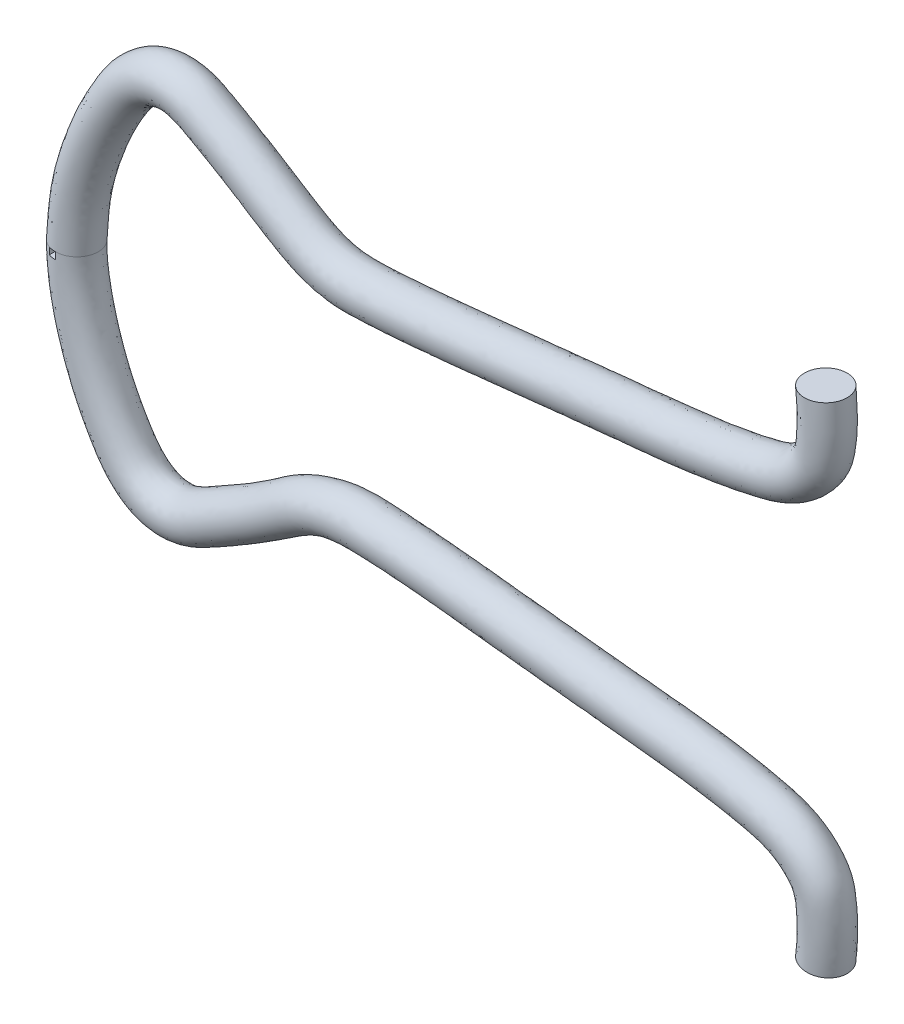
ISO-10303-21;
HEADER;
FILE_DESCRIPTION(('STEP AP214'),'2;1');
FILE_NAME('part.step','',(''),(''),'','','');
FILE_SCHEMA(('AUTOMOTIVE_DESIGN { 1 0 10303 214 1 1 1 1 }'));
ENDSEC;
DATA;
#1=APPLICATION_CONTEXT('core data for automotive mechanical design processes');
#2=APPLICATION_PROTOCOL_DEFINITION('international standard','automotive_design',2000,#1);
#3=PRODUCT_CONTEXT('',#1,'mechanical');
#4=PRODUCT('Part','Part','',(#3));
#5=PRODUCT_RELATED_PRODUCT_CATEGORY('part','',(#4));
#6=PRODUCT_DEFINITION_FORMATION('','',#4);
#7=PRODUCT_DEFINITION_CONTEXT('part definition',#1,'design');
#8=PRODUCT_DEFINITION('design','',#6,#7);
#9=PRODUCT_DEFINITION_SHAPE('','',#8);
#10=(LENGTH_UNIT() NAMED_UNIT(*) SI_UNIT(.MILLI.,.METRE.));
#11=(NAMED_UNIT(*) PLANE_ANGLE_UNIT() SI_UNIT($,.RADIAN.));
#12=(NAMED_UNIT(*) SI_UNIT($,.STERADIAN.) SOLID_ANGLE_UNIT());
#13=UNCERTAINTY_MEASURE_WITH_UNIT(LENGTH_MEASURE(1.E-05),#10,'distance_accuracy_value','');
#14=(GEOMETRIC_REPRESENTATION_CONTEXT(3) GLOBAL_UNCERTAINTY_ASSIGNED_CONTEXT((#13)) GLOBAL_UNIT_ASSIGNED_CONTEXT((#10,
#11,#12)) REPRESENTATION_CONTEXT('',''));
#15=CARTESIAN_POINT('',(0.,0.,0.));
#16=DIRECTION('',(0.,0.,1.));
#17=DIRECTION('',(1.,0.,0.));
#18=AXIS2_PLACEMENT_3D('',#15,#16,#17);
#19=CARTESIAN_POINT('',(-31.85024051314,-0.739097488164255,0.500000000000001));
#20=CARTESIAN_POINT('',(-31.8552836514389,-1.08239667611665,0.500000000000001));
#21=CARTESIAN_POINT('',(-31.762998352297,-1.82891605051562,0.500000000000001));
#22=CARTESIAN_POINT('',(-31.4962403182843,-2.75116930594545,0.500000000000001));
#23=CARTESIAN_POINT('',(-31.1759950504245,-3.5133129920374,0.500000000000001));
#24=CARTESIAN_POINT('',(-30.8753990149459,-4.06797425683743,0.500000000000001));
#25=CARTESIAN_POINT('',(-30.5438551123552,-4.59312531108531,0.500000000000001));
#26=CARTESIAN_POINT('',(-30.1407518570774,-4.92986578830265,0.500000000000001));
#27=CARTESIAN_POINT('',(-29.7519104905496,-5.05477061998919,0.500000000000001));
#28=CARTESIAN_POINT('',(-29.434703656947,-5.07208801477055,0.500000000000001));
#29=CARTESIAN_POINT('',(-29.1064110838216,-4.99467848917008,0.500000000000001));
#30=CARTESIAN_POINT('',(-28.7910258545782,-4.83290003807697,0.500000000000001));
#31=CARTESIAN_POINT('',(-28.1448465375935,-4.47368378659672,0.500000000000001));
#32=CARTESIAN_POINT('',(-27.3499380904424,-4.00696426362659,0.500000000000001));
#33=CARTESIAN_POINT('',(-26.4591769418779,-3.36125254782962,0.500000000000001));
#34=CARTESIAN_POINT('',(-25.5814715165167,-3.09137367913693,0.500000000000001));
#35=CARTESIAN_POINT('',(-24.0326679214186,-3.14931242023839,0.500000000000001));
#36=CARTESIAN_POINT('',(-21.8522938980267,-3.39559727821309,0.500000000000001));
#37=CARTESIAN_POINT('',(-18.8705827000946,-3.71590053426215,0.500000000000001));
#38=CARTESIAN_POINT('',(-16.6992209430342,-3.91923704277046,0.500000000000001));
#39=CARTESIAN_POINT('',(-15.4052937301609,-4.24688618944392,0.500000000000001));
#40=CARTESIAN_POINT('',(-15.0842496913342,-4.38022003763113,0.500000000000001));
#41=CARTESIAN_POINT('',(-14.8001560399814,-4.56601615733175,0.500000000000001));
#42=CARTESIAN_POINT('',(-14.5688398215693,-4.79232220348142,0.500000000000001));
#43=CARTESIAN_POINT('',(-14.3632827133004,-5.09906135302469,0.500000000000001));
#44=CARTESIAN_POINT('',(-14.3159188881753,-5.51757961624325,0.500000000000001));
#45=CARTESIAN_POINT('',(-14.2937130072287,-6.01054136016181,0.500000000000001));
#46=CARTESIAN_POINT('',(-14.3172112254019,-6.35500459542826,0.500000000000001));
#47=CARTESIAN_POINT('',(-14.3394388093002,-6.53926497638514,0.500000000000001));
#48=CARTESIAN_POINT('',(-32.855816893968,-0.739097488164255,0.499999999999999));
#49=CARTESIAN_POINT('',(-32.8608600322669,-1.08239667611665,0.499999999999999));
#50=CARTESIAN_POINT('',(-32.7461859213861,-2.11009620193032,0.499999999999999));
#51=CARTESIAN_POINT('',(-32.4436964154244,-3.08547609316605,0.499999999999999));
#52=CARTESIAN_POINT('',(-32.0815147340565,-3.95796491711765,0.499999999999999));
#53=CARTESIAN_POINT('',(-31.7289888008618,-4.59345533048722,0.499999999999999));
#54=CARTESIAN_POINT('',(-31.3597331451799,-5.21162386501684,0.499999999999999));
#55=CARTESIAN_POINT('',(-30.6398673090752,-5.83339109159899,0.499999999999999));
#56=CARTESIAN_POINT('',(-29.9282124544286,-6.05490192139046,0.499999999999999));
#57=CARTESIAN_POINT('',(-29.3373934949348,-6.08865817660507,0.499999999999999));
#58=CARTESIAN_POINT('',(-28.7089531632595,-5.92875474113626,0.499999999999999));
#59=CARTESIAN_POINT('',(-28.2930278474639,-5.70507262239239,0.499999999999999));
#60=CARTESIAN_POINT('',(-27.6386767057019,-5.34513572777799,0.499999999999999));
#61=CARTESIAN_POINT('',(-26.8261839958269,-4.85010496465445,0.499999999999999));
#62=CARTESIAN_POINT('',(-25.8558878577318,-4.20078673800262,0.499999999999999));
#63=CARTESIAN_POINT('',(-25.5370678803037,-4.12892079312087,0.499999999999999));
#64=CARTESIAN_POINT('',(-24.1716877775103,-4.12157036237866,0.499999999999999));
#65=CARTESIAN_POINT('',(-21.8999743022317,-4.41332766724705,0.499999999999999));
#66=CARTESIAN_POINT('',(-19.0664753376878,-4.69256266776707,0.499999999999999));
#67=CARTESIAN_POINT('',(-16.6392557181453,-4.96551142828545,0.499999999999999));
#68=CARTESIAN_POINT('',(-15.7111019676885,-5.20800931439875,0.499999999999999));
#69=CARTESIAN_POINT('',(-15.5489569868968,-5.2789206615397,0.499999999999999));
#70=CARTESIAN_POINT('',(-15.4293429949705,-5.35720949054591,0.499999999999999));
#71=CARTESIAN_POINT('',(-15.3383699621968,-5.45387224730796,0.499999999999999));
#72=CARTESIAN_POINT('',(-15.3226515082278,-5.47739093782235,0.499999999999999));
#73=CARTESIAN_POINT('',(-15.3305400172304,-5.51782824537994,0.499999999999999));
#74=CARTESIAN_POINT('',(-15.2986006944084,-6.04328885917275,0.499999999999999));
#75=CARTESIAN_POINT('',(-15.3154422594949,-6.23458660896315,0.499999999999999));
#76=CARTESIAN_POINT('',(-15.3376698433931,-6.41884698992003,0.499999999999999));
#77=CARTESIAN_POINT('',(-32.855816893968,-0.739097488164255,-0.500000000000002));
#78=CARTESIAN_POINT('',(-32.8608600322669,-1.08239667611665,-0.500000000000002));
#79=CARTESIAN_POINT('',(-32.7461859213861,-2.11009620193032,-0.500000000000002));
#80=CARTESIAN_POINT('',(-32.4436964154244,-3.08547609316605,-0.500000000000002));
#81=CARTESIAN_POINT('',(-32.0815147340565,-3.95796491711765,-0.500000000000002));
#82=CARTESIAN_POINT('',(-31.7289888008618,-4.59345533048722,-0.500000000000003));
#83=CARTESIAN_POINT('',(-31.3597331451799,-5.21162386501684,-0.500000000000002));
#84=CARTESIAN_POINT('',(-30.6398673090752,-5.83339109159899,-0.500000000000002));
#85=CARTESIAN_POINT('',(-29.9282124544286,-6.05490192139046,-0.500000000000002));
#86=CARTESIAN_POINT('',(-29.3373934949348,-6.08865817660507,-0.500000000000002));
#87=CARTESIAN_POINT('',(-28.7089531632595,-5.92875474113626,-0.500000000000002));
#88=CARTESIAN_POINT('',(-28.2930278474639,-5.70507262239239,-0.500000000000002));
#89=CARTESIAN_POINT('',(-27.6386767057019,-5.34513572777799,-0.500000000000002));
#90=CARTESIAN_POINT('',(-26.8261839958269,-4.85010496465445,-0.500000000000003));
#91=CARTESIAN_POINT('',(-25.8558878577318,-4.20078673800262,-0.500000000000002));
#92=CARTESIAN_POINT('',(-25.5370678803037,-4.12892079312087,-0.500000000000003));
#93=CARTESIAN_POINT('',(-24.1716877775103,-4.12157036237866,-0.500000000000002));
#94=CARTESIAN_POINT('',(-21.8999743022317,-4.41332766724705,-0.500000000000003));
#95=CARTESIAN_POINT('',(-19.0664753376878,-4.69256266776707,-0.500000000000002));
#96=CARTESIAN_POINT('',(-16.6392557181453,-4.96551142828545,-0.500000000000003));
#97=CARTESIAN_POINT('',(-15.7111019676885,-5.20800931439875,-0.500000000000002));
#98=CARTESIAN_POINT('',(-15.5489569868968,-5.2789206615397,-0.500000000000002));
#99=CARTESIAN_POINT('',(-15.4293429949705,-5.35720949054591,-0.500000000000002));
#100=CARTESIAN_POINT('',(-15.3383699621968,-5.45387224730796,-0.500000000000002));
#101=CARTESIAN_POINT('',(-15.3226515082278,-5.47739093782235,-0.500000000000002));
#102=CARTESIAN_POINT('',(-15.3305400172304,-5.51782824537994,-0.500000000000002));
#103=CARTESIAN_POINT('',(-15.2986006944084,-6.04328885917275,-0.500000000000002));
#104=CARTESIAN_POINT('',(-15.3154422594949,-6.23458660896315,-0.500000000000002));
#105=CARTESIAN_POINT('',(-15.3376698433931,-6.41884698992003,-0.500000000000002));
#106=CARTESIAN_POINT('',(-31.85024051314,-0.739097488164255,-0.500000000000001));
#107=CARTESIAN_POINT('',(-31.8552836514389,-1.08239667611665,-0.500000000000001));
#108=CARTESIAN_POINT('',(-31.762998352297,-1.82891605051562,-0.500000000000001));
#109=CARTESIAN_POINT('',(-31.4962403182843,-2.75116930594545,-0.500000000000001));
#110=CARTESIAN_POINT('',(-31.1759950504245,-3.5133129920374,-0.500000000000001));
#111=CARTESIAN_POINT('',(-30.8753990149459,-4.06797425683743,-0.500000000000001));
#112=CARTESIAN_POINT('',(-30.5438551123552,-4.59312531108531,-0.500000000000001));
#113=CARTESIAN_POINT('',(-30.1407518570774,-4.92986578830265,-0.500000000000001));
#114=CARTESIAN_POINT('',(-29.7519104905496,-5.05477061998919,-0.500000000000001));
#115=CARTESIAN_POINT('',(-29.434703656947,-5.07208801477055,-0.500000000000001));
#116=CARTESIAN_POINT('',(-29.1064110838216,-4.99467848917008,-0.500000000000001));
#117=CARTESIAN_POINT('',(-28.7910258545782,-4.83290003807697,-0.500000000000001));
#118=CARTESIAN_POINT('',(-28.1448465375935,-4.47368378659672,-0.500000000000001));
#119=CARTESIAN_POINT('',(-27.3499380904424,-4.00696426362659,-0.500000000000001));
#120=CARTESIAN_POINT('',(-26.4591769418779,-3.36125254782962,-0.500000000000001));
#121=CARTESIAN_POINT('',(-25.5814715165167,-3.09137367913693,-0.500000000000001));
#122=CARTESIAN_POINT('',(-24.0326679214186,-3.14931242023839,-0.500000000000001));
#123=CARTESIAN_POINT('',(-21.8522938980267,-3.39559727821309,-0.500000000000001));
#124=CARTESIAN_POINT('',(-18.8705827000946,-3.71590053426215,-0.500000000000001));
#125=CARTESIAN_POINT('',(-16.6992209430342,-3.91923704277046,-0.500000000000001));
#126=CARTESIAN_POINT('',(-15.4052937301609,-4.24688618944392,-0.500000000000001));
#127=CARTESIAN_POINT('',(-15.0842496913342,-4.38022003763113,-0.500000000000001));
#128=CARTESIAN_POINT('',(-14.8001560399814,-4.56601615733175,-0.500000000000001));
#129=CARTESIAN_POINT('',(-14.5688398215693,-4.79232220348142,-0.500000000000001));
#130=CARTESIAN_POINT('',(-14.3632827133004,-5.09906135302469,-0.500000000000001));
#131=CARTESIAN_POINT('',(-14.3159188881753,-5.51757961624325,-0.500000000000001));
#132=CARTESIAN_POINT('',(-14.2937130072287,-6.01054136016181,-0.500000000000001));
#133=CARTESIAN_POINT('',(-14.3172112254019,-6.35500459542826,-0.500000000000001));
#134=CARTESIAN_POINT('',(-14.3394388093002,-6.53926497638514,-0.500000000000001));
#135=CARTESIAN_POINT('',(-30.844664132312,-0.739097488164255,-0.499999999999999));
#136=CARTESIAN_POINT('',(-30.8497072706109,-1.08239667611665,-0.499999999999999));
#137=CARTESIAN_POINT('',(-30.7798107832079,-1.5477358991009,-0.499999999999999));
#138=CARTESIAN_POINT('',(-30.5487842211442,-2.41686251872486,-0.499999999999999));
#139=CARTESIAN_POINT('',(-30.2704753667924,-3.06866106695715,-0.499999999999999));
#140=CARTESIAN_POINT('',(-30.0218092290299,-3.54249318318764,-0.499999999999999));
#141=CARTESIAN_POINT('',(-29.7279770795306,-3.97462675715379,-0.499999999999999));
#142=CARTESIAN_POINT('',(-29.6416364050797,-4.02634048500629,-0.499999999999999));
#143=CARTESIAN_POINT('',(-29.5756085266706,-4.05463931858793,-0.499999999999999));
#144=CARTESIAN_POINT('',(-29.5320138189591,-4.05551785293601,-0.499999999999999));
#145=CARTESIAN_POINT('',(-29.5038690043837,-4.0606022372039,-0.499999999999999));
#146=CARTESIAN_POINT('',(-29.2890238616924,-3.96072745376155,-0.499999999999999));
#147=CARTESIAN_POINT('',(-28.6510163694851,-3.60223184541546,-0.499999999999999));
#148=CARTESIAN_POINT('',(-27.8736921850578,-3.16382356259872,-0.499999999999999));
#149=CARTESIAN_POINT('',(-27.062466026024,-2.52171835765664,-0.499999999999999));
#150=CARTESIAN_POINT('',(-25.6258751527298,-2.05382656515296,-0.499999999999999));
#151=CARTESIAN_POINT('',(-23.8936480653268,-2.17705447809813,-0.499999999999999));
#152=CARTESIAN_POINT('',(-21.8046134938217,-2.37786688917913,-0.499999999999999));
#153=CARTESIAN_POINT('',(-18.6746900625013,-2.73923840075723,-0.499999999999999));
#154=CARTESIAN_POINT('',(-16.7591861679231,-2.87296265725545,-0.499999999999999));
#155=CARTESIAN_POINT('',(-15.0994854926332,-3.28576306448908,-0.499999999999999));
#156=CARTESIAN_POINT('',(-14.6195423957717,-3.48151941372254,-0.499999999999999));
#157=CARTESIAN_POINT('',(-14.1709690849923,-3.77482282411758,-0.499999999999999));
#158=CARTESIAN_POINT('',(-13.7993096809417,-4.13077215965487,-0.499999999999999));
#159=CARTESIAN_POINT('',(-13.4039139183731,-4.72073176822702,-0.499999999999999));
#160=CARTESIAN_POINT('',(-13.3012977591202,-5.51733098710657,-0.499999999999999));
#161=CARTESIAN_POINT('',(-13.2888253200491,-5.97779386115087,-0.499999999999999));
#162=CARTESIAN_POINT('',(-13.318980191309,-6.47542258189337,-0.499999999999999));
#163=CARTESIAN_POINT('',(-13.3412077752072,-6.65968296285025,-0.499999999999999));
#164=CARTESIAN_POINT('',(-30.844664132312,-0.739097488164255,0.500000000000002));
#165=CARTESIAN_POINT('',(-30.8497072706109,-1.08239667611665,0.500000000000002));
#166=CARTESIAN_POINT('',(-30.7798107832079,-1.5477358991009,0.500000000000002));
#167=CARTESIAN_POINT('',(-30.5487842211442,-2.41686251872486,0.500000000000002));
#168=CARTESIAN_POINT('',(-30.2704753667924,-3.06866106695715,0.500000000000002));
#169=CARTESIAN_POINT('',(-30.0218092290299,-3.54249318318764,0.500000000000003));
#170=CARTESIAN_POINT('',(-29.7279770795306,-3.97462675715379,0.500000000000002));
#171=CARTESIAN_POINT('',(-29.6416364050797,-4.02634048500629,0.500000000000002));
#172=CARTESIAN_POINT('',(-29.5756085266706,-4.05463931858793,0.500000000000002));
#173=CARTESIAN_POINT('',(-29.5320138189591,-4.05551785293601,0.500000000000002));
#174=CARTESIAN_POINT('',(-29.5038690043837,-4.0606022372039,0.500000000000002));
#175=CARTESIAN_POINT('',(-29.2890238616924,-3.96072745376155,0.500000000000002));
#176=CARTESIAN_POINT('',(-28.6510163694851,-3.60223184541546,0.500000000000002));
#177=CARTESIAN_POINT('',(-27.8736921850578,-3.16382356259872,0.500000000000003));
#178=CARTESIAN_POINT('',(-27.062466026024,-2.52171835765664,0.500000000000002));
#179=CARTESIAN_POINT('',(-25.6258751527298,-2.05382656515296,0.500000000000002));
#180=CARTESIAN_POINT('',(-23.8936480653268,-2.17705447809813,0.500000000000002));
#181=CARTESIAN_POINT('',(-21.8046134938217,-2.37786688917913,0.500000000000003));
#182=CARTESIAN_POINT('',(-18.6746900625013,-2.73923840075723,0.500000000000002));
#183=CARTESIAN_POINT('',(-16.7591861679231,-2.87296265725545,0.500000000000003));
#184=CARTESIAN_POINT('',(-15.0994854926332,-3.28576306448908,0.500000000000002));
#185=CARTESIAN_POINT('',(-14.6195423957717,-3.48151941372254,0.500000000000002));
#186=CARTESIAN_POINT('',(-14.1709690849923,-3.77482282411758,0.500000000000002));
#187=CARTESIAN_POINT('',(-13.7993096809417,-4.13077215965487,0.500000000000002));
#188=CARTESIAN_POINT('',(-13.4039139183731,-4.72073176822702,0.500000000000002));
#189=CARTESIAN_POINT('',(-13.3012977591202,-5.51733098710657,0.500000000000002));
#190=CARTESIAN_POINT('',(-13.2888253200491,-5.97779386115087,0.500000000000002));
#191=CARTESIAN_POINT('',(-13.318980191309,-6.47542258189337,0.500000000000002));
#192=CARTESIAN_POINT('',(-13.3412077752072,-6.65968296285025,0.500000000000002));
#193=CARTESIAN_POINT('',(-31.85024051314,-0.739097488164255,0.500000000000001));
#194=CARTESIAN_POINT('',(-31.8552836514389,-1.08239667611665,0.500000000000001));
#195=CARTESIAN_POINT('',(-31.762998352297,-1.82891605051562,0.500000000000001));
#196=CARTESIAN_POINT('',(-31.4962403182843,-2.75116930594545,0.500000000000001));
#197=CARTESIAN_POINT('',(-31.1759950504245,-3.5133129920374,0.500000000000001));
#198=CARTESIAN_POINT('',(-30.8753990149459,-4.06797425683743,0.500000000000001));
#199=CARTESIAN_POINT('',(-30.5438551123552,-4.59312531108531,0.500000000000001));
#200=CARTESIAN_POINT('',(-30.1407518570774,-4.92986578830265,0.500000000000001));
#201=CARTESIAN_POINT('',(-29.7519104905496,-5.05477061998919,0.500000000000001));
#202=CARTESIAN_POINT('',(-29.434703656947,-5.07208801477055,0.500000000000001));
#203=CARTESIAN_POINT('',(-29.1064110838216,-4.99467848917008,0.500000000000001));
#204=CARTESIAN_POINT('',(-28.7910258545782,-4.83290003807697,0.500000000000001));
#205=CARTESIAN_POINT('',(-28.1448465375935,-4.47368378659672,0.500000000000001));
#206=CARTESIAN_POINT('',(-27.3499380904424,-4.00696426362659,0.500000000000001));
#207=CARTESIAN_POINT('',(-26.4591769418779,-3.36125254782962,0.500000000000001));
#208=CARTESIAN_POINT('',(-25.5814715165167,-3.09137367913693,0.500000000000001));
#209=CARTESIAN_POINT('',(-24.0326679214186,-3.14931242023839,0.500000000000001));
#210=CARTESIAN_POINT('',(-21.8522938980267,-3.39559727821309,0.500000000000001));
#211=CARTESIAN_POINT('',(-18.8705827000946,-3.71590053426215,0.500000000000001));
#212=CARTESIAN_POINT('',(-16.6992209430342,-3.91923704277046,0.500000000000001));
#213=CARTESIAN_POINT('',(-15.4052937301609,-4.24688618944392,0.500000000000001));
#214=CARTESIAN_POINT('',(-15.0842496913342,-4.38022003763113,0.500000000000001));
#215=CARTESIAN_POINT('',(-14.8001560399814,-4.56601615733175,0.500000000000001));
#216=CARTESIAN_POINT('',(-14.5688398215693,-4.79232220348142,0.500000000000001));
#217=CARTESIAN_POINT('',(-14.3632827133004,-5.09906135302469,0.500000000000001));
#218=CARTESIAN_POINT('',(-14.3159188881753,-5.51757961624325,0.500000000000001));
#219=CARTESIAN_POINT('',(-14.2937130072287,-6.01054136016181,0.500000000000001));
#220=CARTESIAN_POINT('',(-14.3172112254019,-6.35500459542826,0.500000000000001));
#221=CARTESIAN_POINT('',(-14.3394388093002,-6.53926497638514,0.500000000000001));
#222=(BOUNDED_SURFACE() B_SPLINE_SURFACE(3,3,((#19,#20,#21,#22,#23,#24,#25,#26,#27,#28,#29,#30,
#31,#32,#33,#34,#35,#36,#37,#38,#39,#40,#41,#42,#43,#44,#45,#46,#47),(#48,#49,#50,#51,#52,#53,
#54,#55,#56,#57,#58,#59,#60,#61,#62,#63,#64,#65,#66,#67,#68,#69,#70,#71,#72,#73,#74,#75,#76),
(#77,#78,#79,#80,#81,#82,#83,#84,#85,#86,#87,#88,#89,#90,#91,#92,#93,#94,#95,#96,#97,#98,#99,
#100,#101,#102,#103,#104,#105),(#106,#107,#108,#109,#110,#111,#112,#113,#114,#115,#116,#117,
#118,#119,#120,#121,#122,#123,#124,#125,#126,#127,#128,#129,#130,#131,#132,#133,#134),(#135,
#136,#137,#138,#139,#140,#141,#142,#143,#144,#145,#146,#147,#148,#149,#150,#151,#152,#153,#154,
#155,#156,#157,#158,#159,#160,#161,#162,#163),(#164,#165,#166,#167,#168,#169,#170,#171,#172,
#173,#174,#175,#176,#177,#178,#179,#180,#181,#182,#183,#184,#185,#186,#187,#188,#189,#190,#191,
#192),(#193,#194,#195,#196,#197,#198,#199,#200,#201,#202,#203,#204,#205,#206,#207,#208,#209,
#210,#211,#212,#213,#214,#215,#216,#217,#218,#219,#220,#221)),.UNSPECIFIED.,.T.,.F.,
.F.) B_SPLINE_SURFACE_WITH_KNOTS((4,3,4),(4,1,1,1,1,1,1,1,1,1,1,1,1,1,1,1,1,1,1,1,1,1,1,1,1,1,
4),(0.,0.5,1.),(0.,0.0453080663909508,0.0984238556094882,0.126301054122408,0.154230019640889,
0.18162996670079,0.207998463452138,0.221300453837338,0.234929916301715,0.249422386694303,
0.265217720548691,0.281542247278561,0.347049926004407,0.386829289422081,0.426042239288472,
0.465314949180757,0.590141791791185,0.71605840505547,0.861263029247658,0.876769672795154,
0.891970414615276,0.90691782362175,0.921248219665531,0.934536313034606,0.954674024957773,
0.975507958500653,1.),
.UNSPECIFIED.) GEOMETRIC_REPRESENTATION_ITEM() RATIONAL_B_SPLINE_SURFACE(((1.,1.,1.,1.,1.,1.,1.,
1.,1.,1.,1.,1.,1.,1.,1.,1.,1.,1.,1.,1.,1.,1.,1.,1.,1.,1.,1.,1.,1.),(0.333333333333333,
0.333333333333333,0.333333333333333,0.333333333333333,0.333333333333333,0.333333333333333,
0.333333333333333,0.333333333333333,0.333333333333333,0.333333333333333,0.333333333333333,
0.333333333333333,0.333333333333333,0.333333333333333,0.333333333333333,0.333333333333333,
0.333333333333333,0.333333333333333,0.333333333333334,0.333333333333333,0.333333333333333,
0.333333333333333,0.333333333333333,0.333333333333333,0.333333333333333,0.333333333333333,
0.333333333333333,0.333333333333333,0.333333333333333),(0.333333333333333,0.333333333333333,
0.333333333333333,0.333333333333333,0.333333333333333,0.333333333333333,0.333333333333333,
0.333333333333333,0.333333333333333,0.333333333333333,0.333333333333333,0.333333333333333,
0.333333333333333,0.333333333333333,0.333333333333333,0.333333333333333,0.333333333333333,
0.333333333333333,0.333333333333334,0.333333333333333,0.333333333333333,0.333333333333333,
0.333333333333333,0.333333333333333,0.333333333333333,0.333333333333333,0.333333333333333,
0.333333333333333,0.333333333333333),(1.,1.,1.,1.,1.,1.,1.,1.,1.,1.,1.,1.,1.,1.,1.,1.,1.,1.,1.,
1.,1.,1.,1.,1.,1.,1.,1.,1.,1.),(0.333333333333333,0.333333333333333,0.333333333333333,
0.333333333333333,0.333333333333333,0.333333333333333,0.333333333333333,0.333333333333333,
0.333333333333333,0.333333333333333,0.333333333333333,0.333333333333333,0.333333333333333,
0.333333333333333,0.333333333333333,0.333333333333333,0.333333333333333,0.333333333333333,
0.333333333333334,0.333333333333333,0.333333333333333,0.333333333333333,0.333333333333333,
0.333333333333333,0.333333333333333,0.333333333333333,0.333333333333333,0.333333333333333,
0.333333333333333),(0.333333333333333,0.333333333333333,0.333333333333333,0.333333333333333,
0.333333333333333,0.333333333333333,0.333333333333333,0.333333333333333,0.333333333333333,
0.333333333333333,0.333333333333333,0.333333333333333,0.333333333333333,0.333333333333333,
0.333333333333333,0.333333333333333,0.333333333333333,0.333333333333333,0.333333333333334,
0.333333333333333,0.333333333333333,0.333333333333333,0.333333333333333,0.333333333333333,
0.333333333333333,0.333333333333333,0.333333333333333,0.333333333333333,0.333333333333333),(1.,
1.,1.,1.,1.,1.,1.,1.,1.,1.,1.,1.,1.,1.,1.,1.,1.,1.,1.,1.,1.,1.,1.,1.,1.,1.,1.,1.,1.))) REPRESENTATION_ITEM('') SURFACE());
#223=CARTESIAN_POINT('',(-14.3394388093002,-6.53926497638514,0.500000000000001));
#224=CARTESIAN_POINT('',(-15.3376698433931,-6.41884698992003,0.499999999999999));
#225=CARTESIAN_POINT('',(-15.3376698433931,-6.41884698992003,-0.500000000000002));
#226=CARTESIAN_POINT('',(-14.3394388093002,-6.53926497638514,-0.500000000000001));
#227=CARTESIAN_POINT('',(-13.3412077752072,-6.65968296285025,-0.499999999999999));
#228=CARTESIAN_POINT('',(-13.3412077752072,-6.65968296285025,0.500000000000002));
#229=CARTESIAN_POINT('',(-14.3394388093002,-6.53926497638514,0.500000000000001));
#230=(BOUNDED_CURVE() B_SPLINE_CURVE(3,(#223,#224,#225,#226,#227,#228,#229),.UNSPECIFIED.,.T.,
.F.) B_SPLINE_CURVE_WITH_KNOTS((4,3,4),(0.,0.5,1.),
.UNSPECIFIED.) CURVE() GEOMETRIC_REPRESENTATION_ITEM() RATIONAL_B_SPLINE_CURVE((1.,
0.333333333333333,0.333333333333333,1.,0.333333333333333,0.333333333333333,1.)) REPRESENTATION_ITEM(''));
#231=CARTESIAN_POINT('',(-14.3394388093002,-6.53926497638514,0.500000000000001));
#232=VERTEX_POINT('',#231);
#233=EDGE_CURVE('E85',#232,#232,#230,.F.);
#234=CARTESIAN_POINT('',(-31.85024051314,-0.900710289289549,0.499998913472939));
#235=CARTESIAN_POINT('',(-31.8792338995687,-0.900710289289549,0.499904339239247));
#236=CARTESIAN_POINT('',(-31.9078072658661,-0.900710289289549,0.497401733195915));
#237=CARTESIAN_POINT('',(-31.9641139581979,-0.900710289289549,0.487580457489969));
#238=CARTESIAN_POINT('',(-31.9918472842325,-0.900710289289549,0.480261787827354));
#239=CARTESIAN_POINT('',(-32.0191605901357,-0.900710289289549,0.470535086355099));
#240=B_SPLINE_CURVE_WITH_KNOTS('',3,(#234,#235,#236,#237,#238,#239),.UNSPECIFIED.,.F.,.F.,(4,2,
4),(0.,0.0860482578970775,0.172096515794165),.UNSPECIFIED.);
#241=CARTESIAN_POINT('',(-31.85024051314,-0.900710289289549,0.499998913472939));
#242=VERTEX_POINT('',#241);
#243=CARTESIAN_POINT('',(-32.0191605901357,-0.900710289289549,0.470535086355097));
#244=VERTEX_POINT('',#243);
#245=EDGE_CURVE('E48',#242,#244,#240,.T.);
#246=CARTESIAN_POINT('',(-32.0191605901357,-0.900710289289549,0.470535086355097));
#247=CARTESIAN_POINT('',(-32.0191605901357,-0.87377532710775,0.470805026393329));
#248=CARTESIAN_POINT('',(-32.0191605901357,-0.846840112589742,0.470973483926086));
#249=CARTESIAN_POINT('',(-32.0191605901357,-0.792969178881311,0.47110743398065));
#250=CARTESIAN_POINT('',(-32.0191605901357,-0.766033459690887,0.471072926502457));
#251=CARTESIAN_POINT('',(-32.0191605901357,-0.739097488164255,0.470936936518789));
#252=B_SPLINE_CURVE_WITH_KNOTS('',3,(#246,#247,#248,#249,#250,#251),.UNSPECIFIED.,.F.,.F.,(4,2,
4),(0.,0.0808072238827864,0.161614447765573),.UNSPECIFIED.);
#253=CARTESIAN_POINT('',(-32.0191605901357,-0.739097488164272,0.470936936518791));
#254=VERTEX_POINT('',#253);
#255=EDGE_CURVE('E11',#244,#254,#252,.T.);
#256=CARTESIAN_POINT('',(-31.85024051314,-0.739097488164272,0.500000000000001));
#257=CARTESIAN_POINT('',(-30.844664132312,-0.739097488164272,0.500000000000002));
#258=CARTESIAN_POINT('',(-30.844664132312,-0.739097488164272,-0.499999999999999));
#259=CARTESIAN_POINT('',(-31.85024051314,-0.739097488164272,-0.500000000000001));
#260=CARTESIAN_POINT('',(-32.855816893968,-0.739097488164272,-0.500000000000002));
#261=CARTESIAN_POINT('',(-32.855816893968,-0.739097488164272,0.499999999999999));
#262=CARTESIAN_POINT('',(-31.85024051314,-0.739097488164272,0.500000000000001));
#263=(BOUNDED_CURVE() B_SPLINE_CURVE(3,(#256,#257,#258,#259,#260,#261,#262),.UNSPECIFIED.,.T.,
.F.) B_SPLINE_CURVE_WITH_KNOTS((4,3,4),(0.,0.5,1.),
.UNSPECIFIED.) CURVE() GEOMETRIC_REPRESENTATION_ITEM() RATIONAL_B_SPLINE_CURVE((1.,
0.333333333333333,0.333333333333333,1.,0.333333333333333,0.333333333333333,1.)) REPRESENTATION_ITEM(''));
#264=CARTESIAN_POINT('',(-31.85024051314,-0.739097488164272,0.500000000000001));
#265=VERTEX_POINT('',#264);
#266=EDGE_CURVE('E112',#254,#265,#263,.F.);
#267=CARTESIAN_POINT('',(-31.85024051314,-0.739097488164255,0.500000000000001));
#268=CARTESIAN_POINT('',(-31.85024051314,-0.792968421872686,0.499999637824313));
#269=CARTESIAN_POINT('',(-31.85024051314,-0.846839355581117,0.499999275648626));
#270=CARTESIAN_POINT('',(-31.85024051314,-0.900710289289548,0.499998913472939));
#271=B_SPLINE_CURVE_WITH_KNOTS('',3,(#267,#268,#269,#270),.UNSPECIFIED.,.F.,.F.,(4,4),(0.,
0.161612801128946),.UNSPECIFIED.);
#272=EDGE_CURVE('E126',#265,#242,#271,.T.);
#273=ORIENTED_EDGE('',*,*,#233,.T.);
#274=EDGE_LOOP('',(#273));
#275=FACE_BOUND('',#274,.T.);
#276=ORIENTED_EDGE('',*,*,#245,.T.);
#277=ORIENTED_EDGE('',*,*,#255,.T.);
#278=ORIENTED_EDGE('',*,*,#266,.T.);
#279=ORIENTED_EDGE('',*,*,#272,.T.);
#280=EDGE_LOOP('',(#276,#277,#278,#279));
#281=FACE_BOUND('',#280,.T.);
#282=ADVANCED_FACE('F32',(#275,#281),#222,.T.);
#283=CARTESIAN_POINT('',(-14.3394388093003,5.0610700000566,0.500000000000001));
#284=CARTESIAN_POINT('',(-14.3226369011048,4.87585362633113,0.500000000000001));
#285=CARTESIAN_POINT('',(-14.2915434940782,4.53309445700043,0.500000000000001));
#286=CARTESIAN_POINT('',(-14.3165998340043,4.03716283399738,0.500000000000001));
#287=CARTESIAN_POINT('',(-14.3632149031121,3.62114317305821,0.500000000000001));
#288=CARTESIAN_POINT('',(-14.5682955545628,3.31476114783015,0.500000000000001));
#289=CARTESIAN_POINT('',(-14.8001328153921,3.08780464432725,0.500000000000001));
#290=CARTESIAN_POINT('',(-15.0841477887947,2.90209178436403,0.500000000000001));
#291=CARTESIAN_POINT('',(-15.4052290602466,2.76870626181536,0.500000000000001));
#292=CARTESIAN_POINT('',(-16.6991187663411,2.44105910117381,0.500000000000001));
#293=CARTESIAN_POINT('',(-18.8690480411459,2.23859244204819,0.500000000000001));
#294=CARTESIAN_POINT('',(-21.8570604281007,1.91467955174071,0.500000000000001));
#295=CARTESIAN_POINT('',(-24.1001932213707,1.66953205247261,0.500000000000001));
#296=CARTESIAN_POINT('',(-25.845814600817,1.5959766927713,0.500000000000001));
#297=CARTESIAN_POINT('',(-26.8640883444268,2.17947335405573,0.500000000000001));
#298=CARTESIAN_POINT('',(-27.6402347271901,2.6877126726369,0.500000000000001));
#299=CARTESIAN_POINT('',(-28.2693337611829,3.06328842528765,0.500000000000001));
#300=CARTESIAN_POINT('',(-28.7200529265025,3.31567283747741,0.500000000000001));
#301=CARTESIAN_POINT('',(-29.156738914701,3.55113512734451,0.500000000000001));
#302=CARTESIAN_POINT('',(-29.6235658427914,3.60847620897366,0.500000000000001));
#303=CARTESIAN_POINT('',(-30.1085853111176,3.47818818606518,0.500000000000001));
#304=CARTESIAN_POINT('',(-30.5436580292458,3.1152697202054,0.500000000000001));
#305=CARTESIAN_POINT('',(-30.8753259317095,2.5897260096026,0.500000000000001));
#306=CARTESIAN_POINT('',(-31.1764051393912,2.0351321454019,0.5));
#307=CARTESIAN_POINT('',(-31.4940765415413,1.27298248895615,0.500000000000001));
#308=CARTESIAN_POINT('',(-31.7784764249727,0.350609882278038,0.500000000000001));
#309=CARTESIAN_POINT('',(-31.8276186040352,-0.395593352398396,0.500000000000001));
#310=CARTESIAN_POINT('',(-31.85024051314,-0.739097488164272,0.500000000000001));
#311=CARTESIAN_POINT('',(-13.3394388093003,5.0610700000566,0.500000000000001));
#312=CARTESIAN_POINT('',(-13.3260342543864,4.83056246152815,0.500000000000001));
#313=CARTESIAN_POINT('',(-13.3012279480372,4.40398801326915,0.500000000000001));
#314=CARTESIAN_POINT('',(-13.3143022626568,3.9204109821876,0.500000000000001));
#315=CARTESIAN_POINT('',(-13.4552050857614,3.14631112333896,0.500000000000001));
#316=CARTESIAN_POINT('',(-13.8726538279985,2.58377006080122,0.500000000000001));
#317=CARTESIAN_POINT('',(-14.2527814127606,2.2445450006871,0.500000000000001));
#318=CARTESIAN_POINT('',(-14.7053299704767,1.96987757366561,0.500000000000001));
#319=CARTESIAN_POINT('',(-15.1848217178946,1.78990562765307,0.500000000000001));
#320=CARTESIAN_POINT('',(-16.8295822447148,1.41042342428557,0.5));
#321=CARTESIAN_POINT('',(-18.7474513928644,1.25104912341622,0.500000000000001));
#322=CARTESIAN_POINT('',(-21.9033995787159,0.908331183136855,0.500000000000001));
#323=CARTESIAN_POINT('',(-23.9647206097735,0.675904634856589,0.500000000000001));
#324=CARTESIAN_POINT('',(-26.0741266723721,0.585462658943575,0.500000000000001));
#325=CARTESIAN_POINT('',(-27.5568594180182,1.42793145550721,0.500000000000002));
#326=CARTESIAN_POINT('',(-28.2154475089771,1.86963448558289,0.500000000000001));
#327=CARTESIAN_POINT('',(-28.818504810881,2.22384900258014,0.500000000000003));
#328=CARTESIAN_POINT('',(-29.2673826031648,2.47988967029696,0.500000000000002));
#329=CARTESIAN_POINT('',(-29.5690406987472,2.61295414748414,0.500000000000003));
#330=CARTESIAN_POINT('',(-29.5843642037957,2.57695658305815,0.500000000000003));
#331=CARTESIAN_POINT('',(-29.6631369443867,2.5439316588737,0.500000000000003));
#332=CARTESIAN_POINT('',(-29.7436526991601,2.47726082097618,0.500000000000003));
#333=CARTESIAN_POINT('',(-30.0332947537072,2.04898568784178,0.500000000000004));
#334=CARTESIAN_POINT('',(-30.2782398072946,1.5789304021186,0.500000000000003));
#335=CARTESIAN_POINT('',(-30.5501166925549,0.925903751416365,0.500000000000001));
#336=CARTESIAN_POINT('',(-30.793390973504,0.106120376005919,0.500000000000002));
#337=CARTESIAN_POINT('',(-30.8285014976616,-0.472662810524334,0.500000000000002));
#338=CARTESIAN_POINT('',(-30.844664132312,-0.739097488164272,0.500000000000002));
#339=CARTESIAN_POINT('',(-13.3394388093003,5.0610700000566,-0.500000000000001));
#340=CARTESIAN_POINT('',(-13.3260342543864,4.83056246152815,-0.500000000000001));
#341=CARTESIAN_POINT('',(-13.3012279480372,4.40398801326915,-0.500000000000001));
#342=CARTESIAN_POINT('',(-13.3143022626568,3.9204109821876,-0.5));
#343=CARTESIAN_POINT('',(-13.4552050857614,3.14631112333896,-0.500000000000001));
#344=CARTESIAN_POINT('',(-13.8726538279985,2.58377006080122,-0.5));
#345=CARTESIAN_POINT('',(-14.2527814127606,2.2445450006871,-0.500000000000001));
#346=CARTESIAN_POINT('',(-14.7053299704767,1.96987757366561,-0.500000000000001));
#347=CARTESIAN_POINT('',(-15.1848217178946,1.78990562765307,-0.500000000000001));
#348=CARTESIAN_POINT('',(-16.8295822447148,1.41042342428557,-0.500000000000001));
#349=CARTESIAN_POINT('',(-18.7474513928644,1.25104912341622,-0.5));
#350=CARTESIAN_POINT('',(-21.9033995787159,0.908331183136855,-0.500000000000001));
#351=CARTESIAN_POINT('',(-23.9647206097735,0.675904634856589,-0.5));
#352=CARTESIAN_POINT('',(-26.0741266723721,0.585462658943575,-0.5));
#353=CARTESIAN_POINT('',(-27.5568594180182,1.42793145550721,-0.499999999999999));
#354=CARTESIAN_POINT('',(-28.2154475089771,1.86963448558289,-0.5));
#355=CARTESIAN_POINT('',(-28.818504810881,2.22384900258014,-0.499999999999999));
#356=CARTESIAN_POINT('',(-29.2673826031648,2.47988967029696,-0.499999999999999));
#357=CARTESIAN_POINT('',(-29.5690406987472,2.61295414748414,-0.499999999999998));
#358=CARTESIAN_POINT('',(-29.5843642037957,2.57695658305815,-0.499999999999998));
#359=CARTESIAN_POINT('',(-29.6631369443867,2.5439316588737,-0.499999999999998));
#360=CARTESIAN_POINT('',(-29.7436526991601,2.47726082097618,-0.499999999999999));
#361=CARTESIAN_POINT('',(-30.0332947537072,2.04898568784178,-0.499999999999997));
#362=CARTESIAN_POINT('',(-30.2782398072946,1.5789304021186,-0.499999999999999));
#363=CARTESIAN_POINT('',(-30.5501166925549,0.925903751416365,-0.5));
#364=CARTESIAN_POINT('',(-30.793390973504,0.106120376005919,-0.5));
#365=CARTESIAN_POINT('',(-30.8285014976616,-0.472662810524334,-0.499999999999999));
#366=CARTESIAN_POINT('',(-30.844664132312,-0.739097488164272,-0.499999999999999));
#367=CARTESIAN_POINT('',(-14.3394388093003,5.0610700000566,-0.500000000000001));
#368=CARTESIAN_POINT('',(-14.3226369011048,4.87585362633113,-0.500000000000001));
#369=CARTESIAN_POINT('',(-14.2915434940782,4.53309445700043,-0.500000000000001));
#370=CARTESIAN_POINT('',(-14.3165998340043,4.03716283399738,-0.500000000000001));
#371=CARTESIAN_POINT('',(-14.3632149031121,3.62114317305821,-0.500000000000001));
#372=CARTESIAN_POINT('',(-14.5682955545628,3.31476114783015,-0.500000000000001));
#373=CARTESIAN_POINT('',(-14.8001328153921,3.08780464432725,-0.500000000000001));
#374=CARTESIAN_POINT('',(-15.0841477887947,2.90209178436403,-0.500000000000001));
#375=CARTESIAN_POINT('',(-15.4052290602466,2.76870626181536,-0.500000000000001));
#376=CARTESIAN_POINT('',(-16.6991187663411,2.44105910117381,-0.500000000000001));
#377=CARTESIAN_POINT('',(-18.8690480411459,2.23859244204819,-0.500000000000001));
#378=CARTESIAN_POINT('',(-21.8570604281007,1.91467955174071,-0.500000000000001));
#379=CARTESIAN_POINT('',(-24.1001932213707,1.66953205247261,-0.500000000000001));
#380=CARTESIAN_POINT('',(-25.845814600817,1.5959766927713,-0.500000000000001));
#381=CARTESIAN_POINT('',(-26.8640883444268,2.17947335405573,-0.500000000000001));
#382=CARTESIAN_POINT('',(-27.6402347271901,2.6877126726369,-0.500000000000001));
#383=CARTESIAN_POINT('',(-28.2693337611829,3.06328842528765,-0.500000000000001));
#384=CARTESIAN_POINT('',(-28.7200529265025,3.31567283747741,-0.500000000000001));
#385=CARTESIAN_POINT('',(-29.156738914701,3.55113512734451,-0.500000000000001));
#386=CARTESIAN_POINT('',(-29.6235658427914,3.60847620897366,-0.500000000000001));
#387=CARTESIAN_POINT('',(-30.1085853111176,3.47818818606518,-0.500000000000001));
#388=CARTESIAN_POINT('',(-30.5436580292458,3.1152697202054,-0.500000000000001));
#389=CARTESIAN_POINT('',(-30.8753259317095,2.5897260096026,-0.500000000000001));
#390=CARTESIAN_POINT('',(-31.1764051393912,2.0351321454019,-0.5));
#391=CARTESIAN_POINT('',(-31.4940765415413,1.27298248895615,-0.500000000000001));
#392=CARTESIAN_POINT('',(-31.7784764249727,0.350609882278038,-0.500000000000001));
#393=CARTESIAN_POINT('',(-31.8276186040352,-0.395593352398396,-0.500000000000001));
#394=CARTESIAN_POINT('',(-31.85024051314,-0.739097488164272,-0.500000000000001));
#395=CARTESIAN_POINT('',(-15.3394388093003,5.0610700000566,-0.500000000000001));
#396=CARTESIAN_POINT('',(-15.3192395478233,4.92114479113411,-0.500000000000001));
#397=CARTESIAN_POINT('',(-15.2818590401192,4.66220090073172,-0.500000000000001));
#398=CARTESIAN_POINT('',(-15.3188974053517,4.15391468580716,-0.500000000000001));
#399=CARTESIAN_POINT('',(-15.2712247204628,4.09597522277745,-0.500000000000001));
#400=CARTESIAN_POINT('',(-15.2639372811271,4.04575223485908,-0.500000000000001));
#401=CARTESIAN_POINT('',(-15.3474842180235,3.93106428796741,-0.500000000000001));
#402=CARTESIAN_POINT('',(-15.4629656071127,3.83430599506244,-0.500000000000001));
#403=CARTESIAN_POINT('',(-15.6256364025985,3.74750689597765,-0.500000000000001));
#404=CARTESIAN_POINT('',(-16.5686552879675,3.47169477806207,-0.5));
#405=CARTESIAN_POINT('',(-18.9906446894274,3.22613576068014,-0.500000000000001));
#406=CARTESIAN_POINT('',(-21.8107212774854,2.92102792034456,-0.500000000000001));
#407=CARTESIAN_POINT('',(-24.2356658329678,2.66315947008863,-0.500000000000001));
#408=CARTESIAN_POINT('',(-25.6175025292618,2.60649072659902,-0.500000000000001));
#409=CARTESIAN_POINT('',(-26.1713172708355,2.93101525260426,-0.500000000000002));
#410=CARTESIAN_POINT('',(-27.0650219454032,3.50579085969091,-0.500000000000001));
#411=CARTESIAN_POINT('',(-27.7201627114847,3.90272784799514,-0.500000000000003));
#412=CARTESIAN_POINT('',(-28.1727232498403,4.15145600465788,-0.500000000000003));
#413=CARTESIAN_POINT('',(-28.7444371306548,4.48931610720487,-0.500000000000003));
#414=CARTESIAN_POINT('',(-29.6627674817872,4.63999583488918,-0.500000000000003));
#415=CARTESIAN_POINT('',(-30.5540336778485,4.41244471325666,-0.500000000000003));
#416=CARTESIAN_POINT('',(-31.3436633593315,3.75327861943461,-0.500000000000003));
#417=CARTESIAN_POINT('',(-31.7173571097117,3.13046633136341,-0.500000000000004));
#418=CARTESIAN_POINT('',(-32.0745704714877,2.49133388868519,-0.500000000000003));
#419=CARTESIAN_POINT('',(-32.4380363905277,1.62006122649595,-0.500000000000002));
#420=CARTESIAN_POINT('',(-32.7635618764413,0.595099388550156,-0.500000000000002));
#421=CARTESIAN_POINT('',(-32.8267357104089,-0.318523894272458,-0.500000000000002));
#422=CARTESIAN_POINT('',(-32.855816893968,-0.739097488164272,-0.500000000000002));
#423=CARTESIAN_POINT('',(-15.3394388093003,5.0610700000566,0.500000000000001));
#424=CARTESIAN_POINT('',(-15.3192395478233,4.92114479113411,0.500000000000001));
#425=CARTESIAN_POINT('',(-15.2818590401192,4.66220090073172,0.500000000000001));
#426=CARTESIAN_POINT('',(-15.3188974053517,4.15391468580716,0.500000000000001));
#427=CARTESIAN_POINT('',(-15.2712247204628,4.09597522277745,0.500000000000001));
#428=CARTESIAN_POINT('',(-15.2639372811271,4.04575223485908,0.500000000000001));
#429=CARTESIAN_POINT('',(-15.3474842180235,3.93106428796741,0.500000000000001));
#430=CARTESIAN_POINT('',(-15.4629656071127,3.83430599506244,0.500000000000001));
#431=CARTESIAN_POINT('',(-15.6256364025985,3.74750689597765,0.5));
#432=CARTESIAN_POINT('',(-16.5686552879675,3.47169477806207,0.500000000000001));
#433=CARTESIAN_POINT('',(-18.9906446894274,3.22613576068014,0.5));
#434=CARTESIAN_POINT('',(-21.8107212774854,2.92102792034456,0.500000000000001));
#435=CARTESIAN_POINT('',(-24.2356658329678,2.66315947008863,0.5));
#436=CARTESIAN_POINT('',(-25.6175025292618,2.60649072659902,0.5));
#437=CARTESIAN_POINT('',(-26.1713172708355,2.93101525260426,0.499999999999999));
#438=CARTESIAN_POINT('',(-27.0650219454032,3.50579085969091,0.5));
#439=CARTESIAN_POINT('',(-27.7201627114847,3.90272784799514,0.499999999999999));
#440=CARTESIAN_POINT('',(-28.1727232498403,4.15145600465788,0.499999999999999));
#441=CARTESIAN_POINT('',(-28.7444371306548,4.48931610720487,0.499999999999998));
#442=CARTESIAN_POINT('',(-29.6627674817872,4.63999583488918,0.499999999999999));
#443=CARTESIAN_POINT('',(-30.5540336778485,4.41244471325666,0.499999999999998));
#444=CARTESIAN_POINT('',(-31.3436633593315,3.75327861943461,0.499999999999999));
#445=CARTESIAN_POINT('',(-31.7173571097117,3.13046633136341,0.499999999999997));
#446=CARTESIAN_POINT('',(-32.0745704714877,2.49133388868519,0.499999999999999));
#447=CARTESIAN_POINT('',(-32.4380363905277,1.62006122649595,0.5));
#448=CARTESIAN_POINT('',(-32.7635618764413,0.595099388550156,0.5));
#449=CARTESIAN_POINT('',(-32.8267357104089,-0.318523894272458,0.499999999999999));
#450=CARTESIAN_POINT('',(-32.855816893968,-0.739097488164272,0.499999999999999));
#451=CARTESIAN_POINT('',(-14.3394388093003,5.0610700000566,0.500000000000001));
#452=CARTESIAN_POINT('',(-14.3226369011048,4.87585362633113,0.500000000000001));
#453=CARTESIAN_POINT('',(-14.2915434940782,4.53309445700043,0.500000000000001));
#454=CARTESIAN_POINT('',(-14.3165998340043,4.03716283399738,0.500000000000001));
#455=CARTESIAN_POINT('',(-14.3632149031121,3.62114317305821,0.500000000000001));
#456=CARTESIAN_POINT('',(-14.5682955545628,3.31476114783015,0.500000000000001));
#457=CARTESIAN_POINT('',(-14.8001328153921,3.08780464432725,0.500000000000001));
#458=CARTESIAN_POINT('',(-15.0841477887947,2.90209178436403,0.500000000000001));
#459=CARTESIAN_POINT('',(-15.4052290602466,2.76870626181536,0.500000000000001));
#460=CARTESIAN_POINT('',(-16.6991187663411,2.44105910117381,0.500000000000001));
#461=CARTESIAN_POINT('',(-18.8690480411459,2.23859244204819,0.500000000000001));
#462=CARTESIAN_POINT('',(-21.8570604281007,1.91467955174071,0.500000000000001));
#463=CARTESIAN_POINT('',(-24.1001932213707,1.66953205247261,0.500000000000001));
#464=CARTESIAN_POINT('',(-25.845814600817,1.5959766927713,0.500000000000001));
#465=CARTESIAN_POINT('',(-26.8640883444268,2.17947335405573,0.500000000000001));
#466=CARTESIAN_POINT('',(-27.6402347271901,2.6877126726369,0.500000000000001));
#467=CARTESIAN_POINT('',(-28.2693337611829,3.06328842528765,0.500000000000001));
#468=CARTESIAN_POINT('',(-28.7200529265025,3.31567283747741,0.500000000000001));
#469=CARTESIAN_POINT('',(-29.156738914701,3.55113512734451,0.500000000000001));
#470=CARTESIAN_POINT('',(-29.6235658427914,3.60847620897366,0.500000000000001));
#471=CARTESIAN_POINT('',(-30.1085853111176,3.47818818606518,0.500000000000001));
#472=CARTESIAN_POINT('',(-30.5436580292458,3.1152697202054,0.500000000000001));
#473=CARTESIAN_POINT('',(-30.8753259317095,2.5897260096026,0.500000000000001));
#474=CARTESIAN_POINT('',(-31.1764051393912,2.0351321454019,0.5));
#475=CARTESIAN_POINT('',(-31.4940765415413,1.27298248895615,0.500000000000001));
#476=CARTESIAN_POINT('',(-31.7784764249727,0.350609882278038,0.500000000000001));
#477=CARTESIAN_POINT('',(-31.8276186040352,-0.395593352398396,0.500000000000001));
#478=CARTESIAN_POINT('',(-31.85024051314,-0.739097488164272,0.500000000000001));
#479=(BOUNDED_SURFACE() B_SPLINE_SURFACE(3,3,((#283,#284,#285,#286,#287,#288,#289,#290,#291,
#292,#293,#294,#295,#296,#297,#298,#299,#300,#301,#302,#303,#304,#305,#306,#307,#308,#309,#310),
(#311,#312,#313,#314,#315,#316,#317,#318,#319,#320,#321,#322,#323,#324,#325,#326,#327,#328,#329,
#330,#331,#332,#333,#334,#335,#336,#337,#338),(#339,#340,#341,#342,#343,#344,#345,#346,#347,
#348,#349,#350,#351,#352,#353,#354,#355,#356,#357,#358,#359,#360,#361,#362,#363,#364,#365,#366),
(#367,#368,#369,#370,#371,#372,#373,#374,#375,#376,#377,#378,#379,#380,#381,#382,#383,#384,#385,
#386,#387,#388,#389,#390,#391,#392,#393,#394),(#395,#396,#397,#398,#399,#400,#401,#402,#403,
#404,#405,#406,#407,#408,#409,#410,#411,#412,#413,#414,#415,#416,#417,#418,#419,#420,#421,#422),
(#423,#424,#425,#426,#427,#428,#429,#430,#431,#432,#433,#434,#435,#436,#437,#438,#439,#440,#441,
#442,#443,#444,#445,#446,#447,#448,#449,#450),(#451,#452,#453,#454,#455,#456,#457,#458,#459,
#460,#461,#462,#463,#464,#465,#466,#467,#468,#469,#470,#471,#472,#473,#474,#475,#476,#477,
#478)),.UNSPECIFIED.,.T.,.F.,.F.) B_SPLINE_SURFACE_WITH_KNOTS((4,3,4),(4,1,1,1,1,1,1,1,1,1,1,1,
1,1,1,1,1,1,1,1,1,1,1,1,1,4),(0.,0.5,1.),(0.,0.0244943704727916,0.0453289841910878,
0.0656139626240944,0.0789861395370496,0.0933402088909575,0.10830337814697,0.123511611723708,
0.139019950197201,0.284214902143218,0.410123058285258,0.534941548102736,0.584948383537805,
0.634975199495278,0.685176630357102,0.708456629630558,0.731447941221025,0.753540217680513,
0.773290007879207,0.791997371220326,0.818380458426072,0.845779891413134,0.873707188497029,
0.901582635382974,0.95469495412763,1.),
.UNSPECIFIED.) GEOMETRIC_REPRESENTATION_ITEM() RATIONAL_B_SPLINE_SURFACE(((1.,1.,1.,1.,1.,1.,1.,
1.,1.,1.,1.,1.,1.,1.,1.,1.,1.,1.,1.,1.,1.,1.,1.,1.,1.,1.,1.,1.),(0.333333333333333,
0.333333333333333,0.333333333333333,0.333333333333333,0.333333333333333,0.333333333333333,
0.333333333333333,0.333333333333333,0.333333333333333,0.333333333333333,0.333333333333333,
0.333333333333333,0.333333333333333,0.333333333333333,0.333333333333333,0.333333333333334,
0.333333333333333,0.333333333333333,0.333333333333333,0.333333333333333,0.333333333333333,
0.333333333333333,0.333333333333333,0.333333333333333,0.333333333333333,0.333333333333333,
0.333333333333333,0.333333333333333),(0.333333333333333,0.333333333333333,0.333333333333333,
0.333333333333333,0.333333333333333,0.333333333333333,0.333333333333333,0.333333333333333,
0.333333333333333,0.333333333333333,0.333333333333333,0.333333333333333,0.333333333333333,
0.333333333333333,0.333333333333333,0.333333333333334,0.333333333333333,0.333333333333333,
0.333333333333333,0.333333333333333,0.333333333333333,0.333333333333333,0.333333333333333,
0.333333333333333,0.333333333333333,0.333333333333333,0.333333333333333,0.333333333333333),(1.,
1.,1.,1.,1.,1.,1.,1.,1.,1.,1.,1.,1.,1.,1.,1.,1.,1.,1.,1.,1.,1.,1.,1.,1.,1.,1.,1.),
(0.333333333333333,0.333333333333333,0.333333333333333,0.333333333333333,0.333333333333333,
0.333333333333333,0.333333333333333,0.333333333333333,0.333333333333333,0.333333333333333,
0.333333333333333,0.333333333333333,0.333333333333333,0.333333333333333,0.333333333333333,
0.333333333333334,0.333333333333333,0.333333333333333,0.333333333333333,0.333333333333333,
0.333333333333333,0.333333333333333,0.333333333333333,0.333333333333333,0.333333333333333,
0.333333333333333,0.333333333333333,0.333333333333333),(0.333333333333333,0.333333333333333,
0.333333333333333,0.333333333333333,0.333333333333333,0.333333333333333,0.333333333333333,
0.333333333333333,0.333333333333333,0.333333333333333,0.333333333333333,0.333333333333333,
0.333333333333333,0.333333333333333,0.333333333333333,0.333333333333334,0.333333333333333,
0.333333333333333,0.333333333333333,0.333333333333333,0.333333333333333,0.333333333333333,
0.333333333333333,0.333333333333333,0.333333333333333,0.333333333333333,0.333333333333333,
0.333333333333333),(1.,1.,1.,1.,1.,1.,1.,1.,1.,1.,1.,1.,1.,1.,1.,1.,1.,1.,1.,1.,1.,1.,1.,1.,1.,
1.,1.,1.))) REPRESENTATION_ITEM('') SURFACE());
#480=CARTESIAN_POINT('',(-14.3394388093003,5.0610700000566,0.));
#481=DIRECTION('',(0.,1.,0.));
#482=DIRECTION('',(0.,0.,1.));
#483=AXIS2_PLACEMENT_3D('',#480,#481,#482);
#484=CIRCLE('',#483,0.500000000000001);
#485=CARTESIAN_POINT('',(-14.3394388093003,5.0610700000566,0.500000000000001));
#486=VERTEX_POINT('',#485);
#487=EDGE_CURVE('E120',#486,#486,#484,.T.);
#488=EDGE_CURVE('E113',#265,#254,#263,.F.);
#489=ORIENTED_EDGE('',*,*,#487,.F.);
#490=EDGE_LOOP('',(#489));
#491=FACE_BOUND('',#490,.T.);
#492=ORIENTED_EDGE('',*,*,#488,.F.);
#493=ORIENTED_EDGE('',*,*,#266,.F.);
#494=EDGE_LOOP('',(#492,#493));
#495=FACE_BOUND('',#494,.T.);
#496=ADVANCED_FACE('F34',(#491,#495),#479,.F.);
#497=CARTESIAN_POINT('',(-14.3394388093003,5.0610700000566,0.));
#498=DIRECTION('',(0.,1.,0.));
#499=DIRECTION('',(0.,0.,1.));
#500=AXIS2_PLACEMENT_3D('',#497,#498,#499);
#501=PLANE('',#500);
#502=ORIENTED_EDGE('',*,*,#487,.T.);
#503=EDGE_LOOP('',(#502));
#504=FACE_BOUND('',#503,.T.);
#505=ADVANCED_FACE('F157',(#504),#501,.T.);
#506=CARTESIAN_POINT('',(-14.3394388093002,-6.53926497638514,-0.500000000000001));
#507=DIRECTION('',(0.1197631341622,0.992802493800074,0.));
#508=DIRECTION('',(-0.992802493800074,0.1197631341622,0.));
#509=AXIS2_PLACEMENT_3D('',#506,#507,#508);
#510=PLANE('',#509);
#511=ORIENTED_EDGE('',*,*,#233,.F.);
#512=EDGE_LOOP('',(#511));
#513=FACE_BOUND('',#512,.T.);
#514=ADVANCED_FACE('F153',(#513),#510,.F.);
#515=CARTESIAN_POINT('',(-32.0191605901357,-0.739097488164272,2.));
#516=DIRECTION('',(1.,0.,0.));
#517=DIRECTION('',(0.,0.,-1.));
#518=AXIS2_PLACEMENT_3D('',#515,#516,#517);
#519=PLANE('',#518);
#520=DIRECTION('',(0.,0.,-1.));
#521=VECTOR('',#520,1.);
#522=CARTESIAN_POINT('',(-32.0191605901357,-0.900710289289549,2.));
#523=LINE('',#522,#521);
#524=CARTESIAN_POINT('',(-32.0191605901357,-0.900710289289549,0.));
#525=VERTEX_POINT('',#524);
#526=EDGE_CURVE('E78',#244,#525,#523,.T.);
#527=ORIENTED_EDGE('',*,*,#526,.T.);
#528=DIRECTION('',(0.,-1.,0.));
#529=VECTOR('',#528,1.);
#530=CARTESIAN_POINT('',(-32.0191605901357,-0.739097488164272,0.));
#531=LINE('',#530,#529);
#532=CARTESIAN_POINT('',(-32.0191605901357,-0.739097488164272,0.));
#533=VERTEX_POINT('',#532);
#534=EDGE_CURVE('E82',#533,#525,#531,.T.);
#535=ORIENTED_EDGE('',*,*,#534,.F.);
#536=DIRECTION('',(0.,0.,-1.));
#537=VECTOR('',#536,1.);
#538=CARTESIAN_POINT('',(-32.0191605901357,-0.739097488164272,2.));
#539=LINE('',#538,#537);
#540=EDGE_CURVE('E104',#254,#533,#539,.T.);
#541=ORIENTED_EDGE('',*,*,#540,.F.);
#542=ORIENTED_EDGE('',*,*,#255,.F.);
#543=EDGE_LOOP('',(#527,#535,#541,#542));
#544=FACE_BOUND('',#543,.T.);
#545=ADVANCED_FACE('F80',(#544),#519,.T.);
#546=CARTESIAN_POINT('',(-32.0191605901357,-0.900710289289549,2.));
#547=DIRECTION('',(0.,1.,0.));
#548=DIRECTION('',(0.,0.,1.));
#549=AXIS2_PLACEMENT_3D('',#546,#547,#548);
#550=PLANE('',#549);
#551=DIRECTION('',(0.,0.,-1.));
#552=VECTOR('',#551,1.);
#553=CARTESIAN_POINT('',(-31.85024051314,-0.900710289289549,2.));
#554=LINE('',#553,#552);
#555=CARTESIAN_POINT('',(-31.85024051314,-0.900710289289549,0.));
#556=VERTEX_POINT('',#555);
#557=EDGE_CURVE('E86',#242,#556,#554,.T.);
#558=ORIENTED_EDGE('',*,*,#557,.T.);
#559=DIRECTION('',(1.,0.,0.));
#560=VECTOR('',#559,1.);
#561=CARTESIAN_POINT('',(-32.0191605901357,-0.900710289289549,0.));
#562=LINE('',#561,#560);
#563=EDGE_CURVE('E89',#525,#556,#562,.T.);
#564=ORIENTED_EDGE('',*,*,#563,.F.);
#565=ORIENTED_EDGE('',*,*,#526,.F.);
#566=ORIENTED_EDGE('',*,*,#245,.F.);
#567=EDGE_LOOP('',(#558,#564,#565,#566));
#568=FACE_BOUND('',#567,.T.);
#569=ADVANCED_FACE('F90',(#568),#550,.T.);
#570=CARTESIAN_POINT('',(-31.85024051314,-0.739097488164272,2.));
#571=DIRECTION('',(-1.,0.,0.));
#572=DIRECTION('',(0.,0.,1.));
#573=AXIS2_PLACEMENT_3D('',#570,#571,#572);
#574=PLANE('',#573);
#575=DIRECTION('',(0.,0.,-1.));
#576=VECTOR('',#575,1.);
#577=CARTESIAN_POINT('',(-31.85024051314,-0.739097488164272,2.));
#578=LINE('',#577,#576);
#579=CARTESIAN_POINT('',(-31.85024051314,-0.739097488164272,0.));
#580=VERTEX_POINT('',#579);
#581=EDGE_CURVE('E55',#265,#580,#578,.T.);
#582=ORIENTED_EDGE('',*,*,#581,.T.);
#583=DIRECTION('',(0.,1.,0.));
#584=VECTOR('',#583,1.);
#585=CARTESIAN_POINT('',(-31.85024051314,-0.739097488164272,0.));
#586=LINE('',#585,#584);
#587=EDGE_CURVE('E95',#556,#580,#586,.T.);
#588=ORIENTED_EDGE('',*,*,#587,.F.);
#589=ORIENTED_EDGE('',*,*,#557,.F.);
#590=ORIENTED_EDGE('',*,*,#272,.F.);
#591=EDGE_LOOP('',(#582,#588,#589,#590));
#592=FACE_BOUND('',#591,.T.);
#593=ADVANCED_FACE('F142',(#592),#574,.T.);
#594=CARTESIAN_POINT('',(-32.0191605901357,-0.739097488164272,2.));
#595=DIRECTION('',(0.,-1.,0.));
#596=DIRECTION('',(0.,0.,-1.));
#597=AXIS2_PLACEMENT_3D('',#594,#595,#596);
#598=PLANE('',#597);
#599=ORIENTED_EDGE('',*,*,#540,.T.);
#600=DIRECTION('',(-1.,0.,0.));
#601=VECTOR('',#600,1.);
#602=CARTESIAN_POINT('',(-32.0191605901357,-0.739097488164272,0.));
#603=LINE('',#602,#601);
#604=EDGE_CURVE('E99',#580,#533,#603,.T.);
#605=ORIENTED_EDGE('',*,*,#604,.F.);
#606=ORIENTED_EDGE('',*,*,#581,.F.);
#607=ORIENTED_EDGE('',*,*,#488,.T.);
#608=EDGE_LOOP('',(#599,#605,#606,#607));
#609=FACE_BOUND('',#608,.T.);
#610=ADVANCED_FACE('F146',(#609),#598,.T.);
#611=CARTESIAN_POINT('',(0.,0.,0.));
#612=DIRECTION('',(0.,0.,1.));
#613=DIRECTION('',(1.,0.,0.));
#614=AXIS2_PLACEMENT_3D('',#611,#612,#613);
#615=PLANE('',#614);
#616=ORIENTED_EDGE('',*,*,#534,.T.);
#617=ORIENTED_EDGE('',*,*,#563,.T.);
#618=ORIENTED_EDGE('',*,*,#587,.T.);
#619=ORIENTED_EDGE('',*,*,#604,.T.);
#620=EDGE_LOOP('',(#616,#617,#618,#619));
#621=FACE_BOUND('',#620,.T.);
#622=ADVANCED_FACE('F98',(#621),#615,.T.);
#623=CLOSED_SHELL('',(#282,#496,#505,#514,#545,#569,#593,#610,#622));
#624=MANIFOLD_SOLID_BREP('B2',#623);
#625=ADVANCED_BREP_SHAPE_REPRESENTATION('',(#18,#624),#14);
#626=SHAPE_DEFINITION_REPRESENTATION(#9,#625);
ENDSEC;
END-ISO-10303-21;
